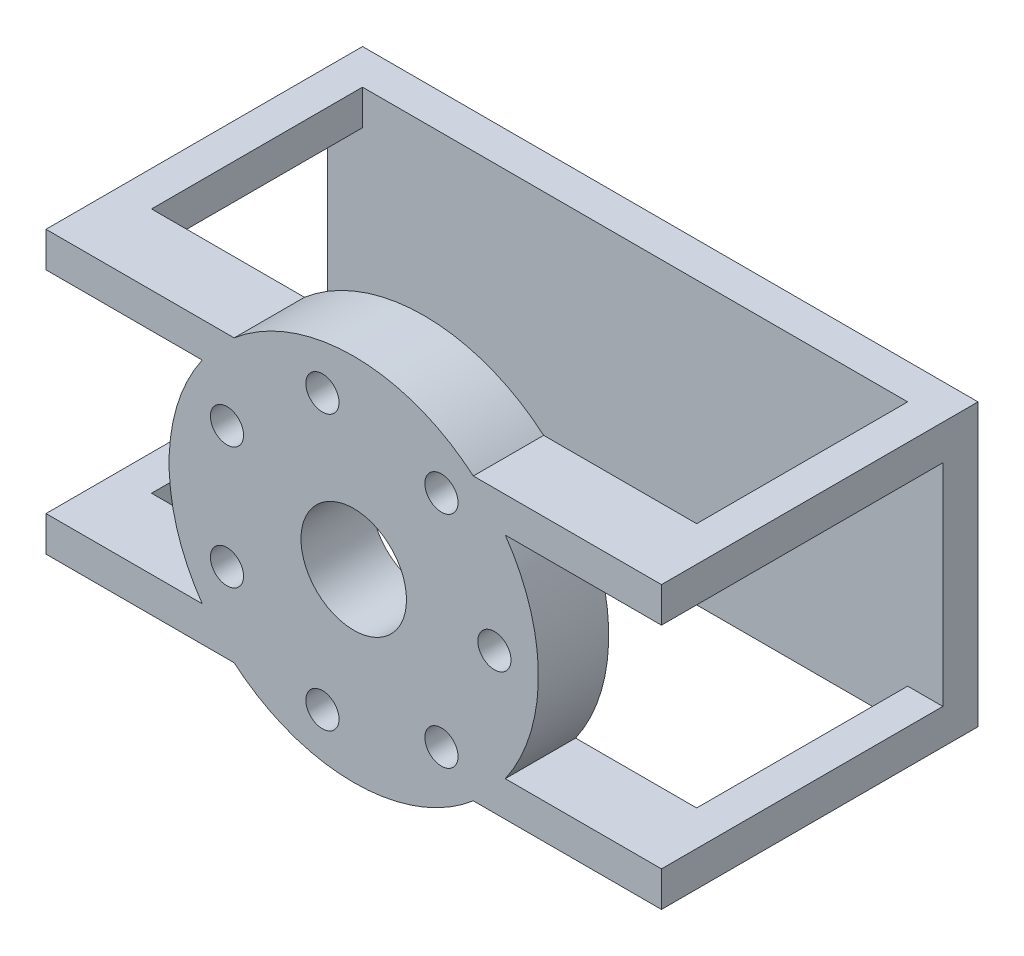
ISO-10303-21;
HEADER;
FILE_DESCRIPTION(('STEP AP214'),'2;1');
FILE_NAME('part.step','',(''),(''),'','','');
FILE_SCHEMA(('AUTOMOTIVE_DESIGN { 1 0 10303 214 1 1 1 1 }'));
ENDSEC;
DATA;
#1=APPLICATION_CONTEXT('core data for automotive mechanical design processes');
#2=APPLICATION_PROTOCOL_DEFINITION('international standard','automotive_design',2000,#1);
#3=PRODUCT_CONTEXT('',#1,'mechanical');
#4=PRODUCT('Part','Part','',(#3));
#5=PRODUCT_RELATED_PRODUCT_CATEGORY('part','',(#4));
#6=PRODUCT_DEFINITION_FORMATION('','',#4);
#7=PRODUCT_DEFINITION_CONTEXT('part definition',#1,'design');
#8=PRODUCT_DEFINITION('design','',#6,#7);
#9=PRODUCT_DEFINITION_SHAPE('','',#8);
#10=(LENGTH_UNIT() NAMED_UNIT(*) SI_UNIT(.MILLI.,.METRE.));
#11=(NAMED_UNIT(*) PLANE_ANGLE_UNIT() SI_UNIT($,.RADIAN.));
#12=(NAMED_UNIT(*) SI_UNIT($,.STERADIAN.) SOLID_ANGLE_UNIT());
#13=UNCERTAINTY_MEASURE_WITH_UNIT(LENGTH_MEASURE(1.E-05),#10,'distance_accuracy_value','');
#14=(GEOMETRIC_REPRESENTATION_CONTEXT(3) GLOBAL_UNCERTAINTY_ASSIGNED_CONTEXT((#13)) GLOBAL_UNIT_ASSIGNED_CONTEXT((#10,
#11,#12)) REPRESENTATION_CONTEXT('',''));
#15=CARTESIAN_POINT('',(0.,0.,0.));
#16=DIRECTION('',(0.,0.,1.));
#17=DIRECTION('',(1.,0.,0.));
#18=AXIS2_PLACEMENT_3D('',#15,#16,#17);
#19=CARTESIAN_POINT('',(-77.5,0.,-35.));
#20=DIRECTION('',(-1.,0.,0.));
#21=DIRECTION('',(0.,0.,1.));
#22=AXIS2_PLACEMENT_3D('',#19,#20,#21);
#23=PLANE('',#22);
#24=DIRECTION('',(0.,1.,0.));
#25=VECTOR('',#24,1.);
#26=CARTESIAN_POINT('',(-77.5,0.,25.));
#27=LINE('',#26,#25);
#28=CARTESIAN_POINT('',(-77.5,70.,25.));
#29=VERTEX_POINT('',#28);
#30=CARTESIAN_POINT('',(-77.5,80.,25.));
#31=VERTEX_POINT('',#30);
#32=EDGE_CURVE('E322',#29,#31,#27,.T.);
#33=ORIENTED_EDGE('',*,*,#32,.F.);
#34=DIRECTION('',(0.,0.,-1.));
#35=VECTOR('',#34,1.);
#36=CARTESIAN_POINT('',(-77.5,70.,-35.));
#37=LINE('',#36,#35);
#38=CARTESIAN_POINT('',(-77.5,70.,-35.));
#39=VERTEX_POINT('',#38);
#40=EDGE_CURVE('E215',#29,#39,#37,.T.);
#41=ORIENTED_EDGE('',*,*,#40,.T.);
#42=DIRECTION('',(0.,1.,0.));
#43=VECTOR('',#42,1.);
#44=CARTESIAN_POINT('',(-77.5,0.,-35.));
#45=LINE('',#44,#43);
#46=CARTESIAN_POINT('',(-77.5,80.,-35.));
#47=VERTEX_POINT('',#46);
#48=EDGE_CURVE('E338',#39,#47,#45,.T.);
#49=ORIENTED_EDGE('',*,*,#48,.T.);
#50=DIRECTION('',(0.,0.,1.));
#51=VECTOR('',#50,1.);
#52=CARTESIAN_POINT('',(-77.5,80.,-35.));
#53=LINE('',#52,#51);
#54=EDGE_CURVE('E307',#47,#31,#53,.T.);
#55=ORIENTED_EDGE('',*,*,#54,.T.);
#56=EDGE_LOOP('',(#33,#41,#49,#55));
#57=FACE_BOUND('',#56,.T.);
#58=ADVANCED_FACE('F35',(#57),#23,.F.);
#59=CARTESIAN_POINT('',(77.5,0.,-35.));
#60=DIRECTION('',(1.,0.,0.));
#61=DIRECTION('',(0.,0.,-1.));
#62=AXIS2_PLACEMENT_3D('',#59,#60,#61);
#63=PLANE('',#62);
#64=DIRECTION('',(0.,1.,0.));
#65=VECTOR('',#64,1.);
#66=CARTESIAN_POINT('',(77.5,0.,-35.));
#67=LINE('',#66,#65);
#68=CARTESIAN_POINT('',(77.5,70.,-35.));
#69=VERTEX_POINT('',#68);
#70=CARTESIAN_POINT('',(77.5,80.,-35.));
#71=VERTEX_POINT('',#70);
#72=EDGE_CURVE('E342',#69,#71,#67,.T.);
#73=ORIENTED_EDGE('',*,*,#72,.F.);
#74=DIRECTION('',(0.,0.,1.));
#75=VECTOR('',#74,1.);
#76=CARTESIAN_POINT('',(77.5,70.,-35.));
#77=LINE('',#76,#75);
#78=CARTESIAN_POINT('',(77.5,70.,25.));
#79=VERTEX_POINT('',#78);
#80=EDGE_CURVE('E303',#69,#79,#77,.T.);
#81=ORIENTED_EDGE('',*,*,#80,.T.);
#82=DIRECTION('',(0.,1.,0.));
#83=VECTOR('',#82,1.);
#84=CARTESIAN_POINT('',(77.5,0.,25.));
#85=LINE('',#84,#83);
#86=CARTESIAN_POINT('',(77.5,80.,25.));
#87=VERTEX_POINT('',#86);
#88=EDGE_CURVE('E346',#79,#87,#85,.T.);
#89=ORIENTED_EDGE('',*,*,#88,.T.);
#90=DIRECTION('',(0.,0.,-1.));
#91=VECTOR('',#90,1.);
#92=CARTESIAN_POINT('',(77.5,80.,-35.));
#93=LINE('',#92,#91);
#94=EDGE_CURVE('E329',#87,#71,#93,.T.);
#95=ORIENTED_EDGE('',*,*,#94,.T.);
#96=EDGE_LOOP('',(#73,#81,#89,#95));
#97=FACE_BOUND('',#96,.T.);
#98=ADVANCED_FACE('F417',(#97),#63,.F.);
#99=CARTESIAN_POINT('',(87.5,80.,-45.));
#100=DIRECTION('',(-1.,0.,0.));
#101=DIRECTION('',(0.,0.,1.));
#102=AXIS2_PLACEMENT_3D('',#99,#100,#101);
#103=PLANE('',#102);
#104=DIRECTION('',(0.,0.,-1.));
#105=VECTOR('',#104,1.);
#106=CARTESIAN_POINT('',(87.5,10.,25.));
#107=LINE('',#106,#105);
#108=CARTESIAN_POINT('',(87.5,9.99999999999998,45.));
#109=VERTEX_POINT('',#108);
#110=CARTESIAN_POINT('',(87.5,10.,-35.));
#111=VERTEX_POINT('',#110);
#112=EDGE_CURVE('E274',#109,#111,#107,.T.);
#113=ORIENTED_EDGE('',*,*,#112,.F.);
#114=DIRECTION('',(0.,-1.,0.));
#115=VECTOR('',#114,1.);
#116=CARTESIAN_POINT('',(87.5,80.,45.));
#117=LINE('',#116,#115);
#118=CARTESIAN_POINT('',(87.5,0.,45.));
#119=VERTEX_POINT('',#118);
#120=EDGE_CURVE('E359',#109,#119,#117,.T.);
#121=ORIENTED_EDGE('',*,*,#120,.T.);
#122=DIRECTION('',(0.,0.,-1.));
#123=VECTOR('',#122,1.);
#124=CARTESIAN_POINT('',(87.5,0.,-45.));
#125=LINE('',#124,#123);
#126=CARTESIAN_POINT('',(87.5,0.,-45.));
#127=VERTEX_POINT('',#126);
#128=EDGE_CURVE('E337',#119,#127,#125,.T.);
#129=ORIENTED_EDGE('',*,*,#128,.T.);
#130=DIRECTION('',(0.,-1.,0.));
#131=VECTOR('',#130,1.);
#132=CARTESIAN_POINT('',(87.5,80.,-45.));
#133=LINE('',#132,#131);
#134=CARTESIAN_POINT('',(87.5,80.,-45.));
#135=VERTEX_POINT('',#134);
#136=EDGE_CURVE('E11',#135,#127,#133,.T.);
#137=ORIENTED_EDGE('',*,*,#136,.F.);
#138=DIRECTION('',(0.,0.,-1.));
#139=VECTOR('',#138,1.);
#140=CARTESIAN_POINT('',(87.5,80.,-45.));
#141=LINE('',#140,#139);
#142=CARTESIAN_POINT('',(87.5,80.,45.));
#143=VERTEX_POINT('',#142);
#144=EDGE_CURVE('E349',#143,#135,#141,.T.);
#145=ORIENTED_EDGE('',*,*,#144,.F.);
#146=CARTESIAN_POINT('',(87.5,70.,45.));
#147=VERTEX_POINT('',#146);
#148=EDGE_CURVE('E369',#143,#147,#117,.T.);
#149=ORIENTED_EDGE('',*,*,#148,.T.);
#150=DIRECTION('',(0.,0.,1.));
#151=VECTOR('',#150,1.);
#152=CARTESIAN_POINT('',(87.5,70.,25.));
#153=LINE('',#152,#151);
#154=CARTESIAN_POINT('',(87.5,70.,-35.));
#155=VERTEX_POINT('',#154);
#156=EDGE_CURVE('E279',#155,#147,#153,.T.);
#157=ORIENTED_EDGE('',*,*,#156,.F.);
#158=DIRECTION('',(0.,1.,0.));
#159=VECTOR('',#158,1.);
#160=CARTESIAN_POINT('',(87.5,70.,-35.));
#161=LINE('',#160,#159);
#162=EDGE_CURVE('E287',#111,#155,#161,.T.);
#163=ORIENTED_EDGE('',*,*,#162,.F.);
#164=EDGE_LOOP('',(#113,#121,#129,#137,#145,#149,#157,#163));
#165=FACE_BOUND('',#164,.T.);
#166=ADVANCED_FACE('F37',(#165),#103,.F.);
#167=CARTESIAN_POINT('',(-87.5,80.,-45.));
#168=DIRECTION('',(0.,0.,1.));
#169=DIRECTION('',(1.,0.,0.));
#170=AXIS2_PLACEMENT_3D('',#167,#168,#169);
#171=PLANE('',#170);
#172=DIRECTION('',(-1.,0.,0.));
#173=VECTOR('',#172,1.);
#174=CARTESIAN_POINT('',(-87.5,0.,-45.));
#175=LINE('',#174,#173);
#176=CARTESIAN_POINT('',(-87.5,0.,-45.));
#177=VERTEX_POINT('',#176);
#178=EDGE_CURVE('E362',#127,#177,#175,.T.);
#179=ORIENTED_EDGE('',*,*,#178,.T.);
#180=DIRECTION('',(0.,-1.,0.));
#181=VECTOR('',#180,1.);
#182=CARTESIAN_POINT('',(-87.5,80.,-45.));
#183=LINE('',#182,#181);
#184=CARTESIAN_POINT('',(-87.5,80.,-45.));
#185=VERTEX_POINT('',#184);
#186=EDGE_CURVE('E43',#185,#177,#183,.T.);
#187=ORIENTED_EDGE('',*,*,#186,.F.);
#188=DIRECTION('',(-1.,0.,0.));
#189=VECTOR('',#188,1.);
#190=CARTESIAN_POINT('',(-87.5,80.,-45.));
#191=LINE('',#190,#189);
#192=EDGE_CURVE('E352',#135,#185,#191,.T.);
#193=ORIENTED_EDGE('',*,*,#192,.F.);
#194=ORIENTED_EDGE('',*,*,#136,.T.);
#195=EDGE_LOOP('',(#179,#187,#193,#194));
#196=FACE_BOUND('',#195,.T.);
#197=ADVANCED_FACE('F479',(#196),#171,.F.);
#198=CARTESIAN_POINT('',(-87.5,80.,-45.));
#199=DIRECTION('',(1.,0.,0.));
#200=DIRECTION('',(0.,0.,-1.));
#201=AXIS2_PLACEMENT_3D('',#198,#199,#200);
#202=PLANE('',#201);
#203=DIRECTION('',(0.,-1.,0.));
#204=VECTOR('',#203,1.);
#205=CARTESIAN_POINT('',(-87.4999999999999,80.,45.));
#206=LINE('',#205,#204);
#207=CARTESIAN_POINT('',(-87.4999999999999,9.99999999999999,45.));
#208=VERTEX_POINT('',#207);
#209=CARTESIAN_POINT('',(-87.4999999999999,0.,45.));
#210=VERTEX_POINT('',#209);
#211=EDGE_CURVE('E372',#208,#210,#206,.T.);
#212=ORIENTED_EDGE('',*,*,#211,.F.);
#213=DIRECTION('',(0.,0.,-1.));
#214=VECTOR('',#213,1.);
#215=CARTESIAN_POINT('',(-87.5,10.,24.9999999999999));
#216=LINE('',#215,#214);
#217=CARTESIAN_POINT('',(-87.5,9.99999999999999,-35.));
#218=VERTEX_POINT('',#217);
#219=EDGE_CURVE('E275',#208,#218,#216,.T.);
#220=ORIENTED_EDGE('',*,*,#219,.T.);
#221=DIRECTION('',(0.,1.,0.));
#222=VECTOR('',#221,1.);
#223=CARTESIAN_POINT('',(-87.5,70.,-35.));
#224=LINE('',#223,#222);
#225=CARTESIAN_POINT('',(-87.5,70.,-35.));
#226=VERTEX_POINT('',#225);
#227=EDGE_CURVE('E278',#218,#226,#224,.T.);
#228=ORIENTED_EDGE('',*,*,#227,.T.);
#229=DIRECTION('',(0.,0.,1.));
#230=VECTOR('',#229,1.);
#231=CARTESIAN_POINT('',(-87.5,70.,25.));
#232=LINE('',#231,#230);
#233=CARTESIAN_POINT('',(-87.4999999999999,70.,45.));
#234=VERTEX_POINT('',#233);
#235=EDGE_CURVE('E282',#226,#234,#232,.T.);
#236=ORIENTED_EDGE('',*,*,#235,.T.);
#237=CARTESIAN_POINT('',(-87.4999999999999,80.,45.));
#238=VERTEX_POINT('',#237);
#239=EDGE_CURVE('E373',#238,#234,#206,.T.);
#240=ORIENTED_EDGE('',*,*,#239,.F.);
#241=DIRECTION('',(0.,0.,1.));
#242=VECTOR('',#241,1.);
#243=CARTESIAN_POINT('',(-87.5,80.,-45.));
#244=LINE('',#243,#242);
#245=EDGE_CURVE('E355',#185,#238,#244,.T.);
#246=ORIENTED_EDGE('',*,*,#245,.F.);
#247=ORIENTED_EDGE('',*,*,#186,.T.);
#248=DIRECTION('',(0.,0.,1.));
#249=VECTOR('',#248,1.);
#250=CARTESIAN_POINT('',(-87.5,0.,-45.));
#251=LINE('',#250,#249);
#252=EDGE_CURVE('E364',#177,#210,#251,.T.);
#253=ORIENTED_EDGE('',*,*,#252,.T.);
#254=EDGE_LOOP('',(#212,#220,#228,#236,#240,#246,#247,#253));
#255=FACE_BOUND('',#254,.T.);
#256=ADVANCED_FACE('F381',(#255),#202,.F.);
#257=CARTESIAN_POINT('',(-87.4999999999999,80.,45.));
#258=DIRECTION('',(0.,0.,-1.));
#259=DIRECTION('',(-1.,0.,0.));
#260=AXIS2_PLACEMENT_3D('',#257,#258,#259);
#261=PLANE('',#260);
#262=CARTESIAN_POINT('',(0.,40.,45.));
#263=DIRECTION('',(0.,0.,1.));
#264=DIRECTION('',(1.,0.,0.));
#265=AXIS2_PLACEMENT_3D('',#262,#263,#264);
#266=CIRCLE('',#265,15.);
#267=CARTESIAN_POINT('',(15.,40.,45.));
#268=VERTEX_POINT('',#267);
#269=EDGE_CURVE('E751',#268,#268,#266,.T.);
#270=ORIENTED_EDGE('',*,*,#269,.F.);
#271=EDGE_LOOP('',(#270));
#272=FACE_BOUND('',#271,.T.);
#273=CARTESIAN_POINT('',(-8.90083735825273,78.9971164872729,45.));
#274=DIRECTION('',(0.,0.,1.));
#275=DIRECTION('',(-0.222520933956318,0.974927912181823,0.));
#276=AXIS2_PLACEMENT_3D('',#273,#274,#275);
#277=CIRCLE('',#276,4.71520780479736);
#278=CARTESIAN_POINT('',(-9.95006980277436,83.5941041879074,45.));
#279=VERTEX_POINT('',#278);
#280=EDGE_CURVE('E746',#279,#279,#277,.T.);
#281=ORIENTED_EDGE('',*,*,#280,.F.);
#282=EDGE_LOOP('',(#281));
#283=FACE_BOUND('',#282,.T.);
#284=CARTESIAN_POINT('',(-36.0387547160969,57.3553495647021,45.));
#285=DIRECTION('',(0.,0.,1.));
#286=DIRECTION('',(-0.900968867902422,0.433883739117553,0.));
#287=AXIS2_PLACEMENT_3D('',#284,#285,#286);
#288=CIRCLE('',#287,4.71520780479736);
#289=CARTESIAN_POINT('',(-40.2870101539098,59.4012015577638,45.));
#290=VERTEX_POINT('',#289);
#291=EDGE_CURVE('E740',#290,#290,#288,.T.);
#292=ORIENTED_EDGE('',*,*,#291,.F.);
#293=EDGE_LOOP('',(#292));
#294=FACE_BOUND('',#293,.T.);
#295=CARTESIAN_POINT('',(-36.0387547160966,22.6446504352974,45.));
#296=DIRECTION('',(0.,0.,1.));
#297=DIRECTION('',(-0.900968867902416,-0.433883739117565,0.));
#298=AXIS2_PLACEMENT_3D('',#295,#296,#297);
#299=CIRCLE('',#298,4.71520780479736);
#300=CARTESIAN_POINT('',(-40.2870101539095,20.5987984422356,45.));
#301=VERTEX_POINT('',#300);
#302=EDGE_CURVE('E734',#301,#301,#299,.T.);
#303=ORIENTED_EDGE('',*,*,#302,.F.);
#304=EDGE_LOOP('',(#303));
#305=FACE_BOUND('',#304,.T.);
#306=CARTESIAN_POINT('',(-8.9008373582522,1.00288351272697,45.));
#307=DIRECTION('',(0.,0.,1.));
#308=DIRECTION('',(-0.222520933956305,-0.974927912181826,0.));
#309=AXIS2_PLACEMENT_3D('',#306,#307,#308);
#310=CIRCLE('',#309,4.71520780479736);
#311=CARTESIAN_POINT('',(-9.95006980277377,-3.59410418790757,45.));
#312=VERTEX_POINT('',#311);
#313=EDGE_CURVE('E728',#312,#312,#310,.T.);
#314=ORIENTED_EDGE('',*,*,#313,.F.);
#315=EDGE_LOOP('',(#314));
#316=FACE_BOUND('',#315,.T.);
#317=CARTESIAN_POINT('',(24.9395920743497,8.72674070127911,45.));
#318=DIRECTION('',(0.,0.,1.));
#319=DIRECTION('',(0.623489801858743,-0.781831482468022,0.));
#320=AXIS2_PLACEMENT_3D('',#317,#318,#319);
#321=CIRCLE('',#320,4.71520780479736);
#322=CARTESIAN_POINT('',(27.8794760542856,5.04024279310961,45.));
#323=VERTEX_POINT('',#322);
#324=EDGE_CURVE('E721',#323,#323,#321,.T.);
#325=ORIENTED_EDGE('',*,*,#324,.F.);
#326=EDGE_LOOP('',(#325));
#327=FACE_BOUND('',#326,.T.);
#328=CARTESIAN_POINT('',(24.9395920743493,71.2732592987212,45.));
#329=DIRECTION('',(0.,0.,1.));
#330=DIRECTION('',(0.623489801858732,0.781831482468031,0.));
#331=AXIS2_PLACEMENT_3D('',#328,#329,#330);
#332=CIRCLE('',#331,4.71520780479736);
#333=CARTESIAN_POINT('',(27.8794760542851,74.9597572068908,45.));
#334=VERTEX_POINT('',#333);
#335=EDGE_CURVE('E713',#334,#334,#332,.T.);
#336=ORIENTED_EDGE('',*,*,#335,.F.);
#337=EDGE_LOOP('',(#336));
#338=FACE_BOUND('',#337,.T.);
#339=CARTESIAN_POINT('',(40.,40.,45.));
#340=DIRECTION('',(0.,0.,1.));
#341=DIRECTION('',(1.,0.,0.));
#342=AXIS2_PLACEMENT_3D('',#339,#340,#341);
#343=CIRCLE('',#342,4.71520780479736);
#344=CARTESIAN_POINT('',(44.7152078047974,40.,45.));
#345=VERTEX_POINT('',#344);
#346=EDGE_CURVE('E227',#345,#345,#343,.T.);
#347=ORIENTED_EDGE('',*,*,#346,.F.);
#348=EDGE_LOOP('',(#347));
#349=FACE_BOUND('',#348,.T.);
#350=CARTESIAN_POINT('',(0.,40.,45.));
#351=DIRECTION('',(0.,0.,-1.));
#352=DIRECTION('',(1.,0.,0.));
#353=AXIS2_PLACEMENT_3D('',#350,#351,#352);
#354=CIRCLE('',#353,52.5);
#355=CARTESIAN_POINT('',(-43.0842198490352,10.,45.));
#356=VERTEX_POINT('',#355);
#357=CARTESIAN_POINT('',(-43.0842198490352,70.,45.));
#358=VERTEX_POINT('',#357);
#359=EDGE_CURVE('E204',#356,#358,#354,.T.);
#360=ORIENTED_EDGE('',*,*,#359,.F.);
#361=DIRECTION('',(1.,0.,0.));
#362=VECTOR('',#361,1.);
#363=CARTESIAN_POINT('',(-43.0842198490352,10.,45.));
#364=LINE('',#363,#362);
#365=EDGE_CURVE('E221',#208,#356,#364,.T.);
#366=ORIENTED_EDGE('',*,*,#365,.F.);
#367=ORIENTED_EDGE('',*,*,#211,.T.);
#368=DIRECTION('',(1.,0.,0.));
#369=VECTOR('',#368,1.);
#370=CARTESIAN_POINT('',(-87.4999999999999,0.,45.));
#371=LINE('',#370,#369);
#372=CARTESIAN_POINT('',(-34.0036762718386,0.,45.));
#373=VERTEX_POINT('',#372);
#374=EDGE_CURVE('E353',#210,#373,#371,.T.);
#375=ORIENTED_EDGE('',*,*,#374,.T.);
#376=CARTESIAN_POINT('',(0.,40.,45.));
#377=DIRECTION('',(0.,0.,1.));
#378=DIRECTION('',(1.,0.,0.));
#379=AXIS2_PLACEMENT_3D('',#376,#377,#378);
#380=CIRCLE('',#379,52.5);
#381=CARTESIAN_POINT('',(34.0036762718386,0.,45.));
#382=VERTEX_POINT('',#381);
#383=EDGE_CURVE('E58',#373,#382,#380,.T.);
#384=ORIENTED_EDGE('',*,*,#383,.T.);
#385=EDGE_CURVE('E367',#382,#119,#371,.T.);
#386=ORIENTED_EDGE('',*,*,#385,.T.);
#387=ORIENTED_EDGE('',*,*,#120,.F.);
#388=DIRECTION('',(1.,0.,0.));
#389=VECTOR('',#388,1.);
#390=CARTESIAN_POINT('',(43.0842198490352,9.99999999999998,45.));
#391=LINE('',#390,#389);
#392=CARTESIAN_POINT('',(43.0842198490352,9.99999999999995,45.));
#393=VERTEX_POINT('',#392);
#394=EDGE_CURVE('E240',#393,#109,#391,.T.);
#395=ORIENTED_EDGE('',*,*,#394,.F.);
#396=CARTESIAN_POINT('',(0.,40.,45.));
#397=DIRECTION('',(0.,0.,-1.));
#398=DIRECTION('',(1.,0.,0.));
#399=AXIS2_PLACEMENT_3D('',#396,#397,#398);
#400=CIRCLE('',#399,52.5);
#401=CARTESIAN_POINT('',(43.0842198490352,70.,45.));
#402=VERTEX_POINT('',#401);
#403=EDGE_CURVE('E248',#402,#393,#400,.T.);
#404=ORIENTED_EDGE('',*,*,#403,.F.);
#405=DIRECTION('',(-1.,0.,0.));
#406=VECTOR('',#405,1.);
#407=CARTESIAN_POINT('',(87.5,70.,45.));
#408=LINE('',#407,#406);
#409=EDGE_CURVE('E234',#147,#402,#408,.T.);
#410=ORIENTED_EDGE('',*,*,#409,.F.);
#411=ORIENTED_EDGE('',*,*,#148,.F.);
#412=DIRECTION('',(1.,0.,0.));
#413=VECTOR('',#412,1.);
#414=CARTESIAN_POINT('',(-87.4999999999999,80.,45.));
#415=LINE('',#414,#413);
#416=CARTESIAN_POINT('',(34.0036762718386,80.,45.));
#417=VERTEX_POINT('',#416);
#418=EDGE_CURVE('E357',#417,#143,#415,.T.);
#419=ORIENTED_EDGE('',*,*,#418,.F.);
#420=CARTESIAN_POINT('',(-34.0036762718386,80.,45.));
#421=VERTEX_POINT('',#420);
#422=EDGE_CURVE('E261',#417,#421,#380,.T.);
#423=ORIENTED_EDGE('',*,*,#422,.T.);
#424=EDGE_CURVE('E50',#238,#421,#415,.T.);
#425=ORIENTED_EDGE('',*,*,#424,.F.);
#426=ORIENTED_EDGE('',*,*,#239,.T.);
#427=DIRECTION('',(-1.,0.,0.));
#428=VECTOR('',#427,1.);
#429=CARTESIAN_POINT('',(-43.0842198490352,70.,45.));
#430=LINE('',#429,#428);
#431=EDGE_CURVE('E224',#358,#234,#430,.T.);
#432=ORIENTED_EDGE('',*,*,#431,.F.);
#433=EDGE_LOOP('',(#360,#366,#367,#375,#384,#386,#387,#395,#404,#410,#411,#419,#423,#425,#426,#432));
#434=FACE_BOUND('',#433,.T.);
#435=ADVANCED_FACE('F388',(#272,#283,#294,#305,#316,#327,#338,#349,#434),#261,.F.);
#436=CARTESIAN_POINT('',(0.,80.,0.));
#437=DIRECTION('',(0.,1.,0.));
#438=DIRECTION('',(0.,0.,1.));
#439=AXIS2_PLACEMENT_3D('',#436,#437,#438);
#440=PLANE('',#439);
#441=DIRECTION('',(0.,0.,1.));
#442=VECTOR('',#441,1.);
#443=CARTESIAN_POINT('',(-34.0036762718386,80.,25.));
#444=LINE('',#443,#442);
#445=CARTESIAN_POINT('',(-34.0036762718386,80.,25.));
#446=VERTEX_POINT('',#445);
#447=EDGE_CURVE('E272',#446,#421,#444,.T.);
#448=ORIENTED_EDGE('',*,*,#447,.F.);
#449=DIRECTION('',(1.,0.,0.));
#450=VECTOR('',#449,1.);
#451=CARTESIAN_POINT('',(-77.5,80.,25.));
#452=LINE('',#451,#450);
#453=EDGE_CURVE('E326',#31,#446,#452,.T.);
#454=ORIENTED_EDGE('',*,*,#453,.F.);
#455=ORIENTED_EDGE('',*,*,#54,.F.);
#456=DIRECTION('',(-1.,0.,0.));
#457=VECTOR('',#456,1.);
#458=CARTESIAN_POINT('',(-77.5,80.,-35.));
#459=LINE('',#458,#457);
#460=EDGE_CURVE('E312',#71,#47,#459,.T.);
#461=ORIENTED_EDGE('',*,*,#460,.F.);
#462=ORIENTED_EDGE('',*,*,#94,.F.);
#463=CARTESIAN_POINT('',(34.0036762718386,80.,25.));
#464=VERTEX_POINT('',#463);
#465=EDGE_CURVE('E325',#464,#87,#452,.T.);
#466=ORIENTED_EDGE('',*,*,#465,.F.);
#467=DIRECTION('',(0.,0.,1.));
#468=VECTOR('',#467,1.);
#469=CARTESIAN_POINT('',(34.0036762718386,80.,25.));
#470=LINE('',#469,#468);
#471=EDGE_CURVE('E269',#417,#464,#470,.F.);
#472=ORIENTED_EDGE('',*,*,#471,.F.);
#473=ORIENTED_EDGE('',*,*,#418,.T.);
#474=ORIENTED_EDGE('',*,*,#144,.T.);
#475=ORIENTED_EDGE('',*,*,#192,.T.);
#476=ORIENTED_EDGE('',*,*,#245,.T.);
#477=ORIENTED_EDGE('',*,*,#424,.T.);
#478=EDGE_LOOP('',(#448,#454,#455,#461,#462,#466,#472,#473,#474,#475,#476,#477));
#479=FACE_BOUND('',#478,.T.);
#480=ADVANCED_FACE('F423',(#479),#440,.T.);
#481=CARTESIAN_POINT('',(0.,0.,0.));
#482=DIRECTION('',(0.,1.,0.));
#483=DIRECTION('',(0.,0.,1.));
#484=AXIS2_PLACEMENT_3D('',#481,#482,#483);
#485=PLANE('',#484);
#486=DIRECTION('',(1.,0.,0.));
#487=VECTOR('',#486,1.);
#488=CARTESIAN_POINT('',(-77.5,0.,25.));
#489=LINE('',#488,#487);
#490=CARTESIAN_POINT('',(-77.5,0.,25.));
#491=VERTEX_POINT('',#490);
#492=CARTESIAN_POINT('',(-34.0036762718386,0.,25.));
#493=VERTEX_POINT('',#492);
#494=EDGE_CURVE('E313',#491,#493,#489,.T.);
#495=ORIENTED_EDGE('',*,*,#494,.T.);
#496=DIRECTION('',(0.,0.,1.));
#497=VECTOR('',#496,1.);
#498=CARTESIAN_POINT('',(-34.0036762718386,0.,25.));
#499=LINE('',#498,#497);
#500=EDGE_CURVE('E266',#493,#373,#499,.T.);
#501=ORIENTED_EDGE('',*,*,#500,.T.);
#502=ORIENTED_EDGE('',*,*,#374,.F.);
#503=ORIENTED_EDGE('',*,*,#252,.F.);
#504=ORIENTED_EDGE('',*,*,#178,.F.);
#505=ORIENTED_EDGE('',*,*,#128,.F.);
#506=ORIENTED_EDGE('',*,*,#385,.F.);
#507=DIRECTION('',(0.,0.,1.));
#508=VECTOR('',#507,1.);
#509=CARTESIAN_POINT('',(34.0036762718386,0.,25.));
#510=LINE('',#509,#508);
#511=CARTESIAN_POINT('',(34.0036762718386,0.,25.));
#512=VERTEX_POINT('',#511);
#513=EDGE_CURVE('E259',#382,#512,#510,.F.);
#514=ORIENTED_EDGE('',*,*,#513,.T.);
#515=CARTESIAN_POINT('',(77.5,0.,25.));
#516=VERTEX_POINT('',#515);
#517=EDGE_CURVE('E311',#512,#516,#489,.T.);
#518=ORIENTED_EDGE('',*,*,#517,.T.);
#519=DIRECTION('',(0.,0.,-1.));
#520=VECTOR('',#519,1.);
#521=CARTESIAN_POINT('',(77.5,0.,-35.));
#522=LINE('',#521,#520);
#523=CARTESIAN_POINT('',(77.5,0.,-35.));
#524=VERTEX_POINT('',#523);
#525=EDGE_CURVE('E316',#516,#524,#522,.T.);
#526=ORIENTED_EDGE('',*,*,#525,.T.);
#527=DIRECTION('',(-1.,0.,0.));
#528=VECTOR('',#527,1.);
#529=CARTESIAN_POINT('',(-77.5,0.,-35.));
#530=LINE('',#529,#528);
#531=CARTESIAN_POINT('',(-77.5,0.,-35.));
#532=VERTEX_POINT('',#531);
#533=EDGE_CURVE('E319',#524,#532,#530,.T.);
#534=ORIENTED_EDGE('',*,*,#533,.T.);
#535=DIRECTION('',(0.,0.,1.));
#536=VECTOR('',#535,1.);
#537=CARTESIAN_POINT('',(-77.5,0.,-35.));
#538=LINE('',#537,#536);
#539=EDGE_CURVE('E308',#532,#491,#538,.T.);
#540=ORIENTED_EDGE('',*,*,#539,.T.);
#541=EDGE_LOOP('',(#495,#501,#502,#503,#504,#505,#506,#514,#518,#526,#534,#540));
#542=FACE_BOUND('',#541,.T.);
#543=ADVANCED_FACE('F386',(#542),#485,.F.);
#544=CARTESIAN_POINT('',(-77.5,10.,-35.));
#545=VERTEX_POINT('',#544);
#546=EDGE_CURVE('E334',#532,#545,#45,.T.);
#547=ORIENTED_EDGE('',*,*,#546,.T.);
#548=DIRECTION('',(0.,0.,1.));
#549=VECTOR('',#548,1.);
#550=CARTESIAN_POINT('',(-77.5,10.,-35.));
#551=LINE('',#550,#549);
#552=CARTESIAN_POINT('',(-77.5,10.,25.));
#553=VERTEX_POINT('',#552);
#554=EDGE_CURVE('E300',#545,#553,#551,.T.);
#555=ORIENTED_EDGE('',*,*,#554,.T.);
#556=EDGE_CURVE('E347',#491,#553,#27,.T.);
#557=ORIENTED_EDGE('',*,*,#556,.F.);
#558=ORIENTED_EDGE('',*,*,#539,.F.);
#559=EDGE_LOOP('',(#547,#555,#557,#558));
#560=FACE_BOUND('',#559,.T.);
#561=ADVANCED_FACE('F398',(#560),#23,.F.);
#562=CARTESIAN_POINT('',(-77.5,0.,-35.));
#563=DIRECTION('',(0.,0.,-1.));
#564=DIRECTION('',(-1.,0.,0.));
#565=AXIS2_PLACEMENT_3D('',#562,#563,#564);
#566=PLANE('',#565);
#567=CARTESIAN_POINT('',(77.5,10.,-35.));
#568=VERTEX_POINT('',#567);
#569=EDGE_CURVE('E339',#524,#568,#67,.T.);
#570=ORIENTED_EDGE('',*,*,#569,.T.);
#571=DIRECTION('',(1.,0.,0.));
#572=VECTOR('',#571,1.);
#573=CARTESIAN_POINT('',(-87.5,10.,-35.));
#574=LINE('',#573,#572);
#575=EDGE_CURVE('E284',#568,#111,#574,.T.);
#576=ORIENTED_EDGE('',*,*,#575,.T.);
#577=ORIENTED_EDGE('',*,*,#162,.T.);
#578=DIRECTION('',(1.,0.,0.));
#579=VECTOR('',#578,1.);
#580=CARTESIAN_POINT('',(-87.5,70.,-35.));
#581=LINE('',#580,#579);
#582=EDGE_CURVE('E294',#69,#155,#581,.T.);
#583=ORIENTED_EDGE('',*,*,#582,.F.);
#584=ORIENTED_EDGE('',*,*,#72,.T.);
#585=ORIENTED_EDGE('',*,*,#460,.T.);
#586=ORIENTED_EDGE('',*,*,#48,.F.);
#587=EDGE_CURVE('E291',#226,#39,#581,.T.);
#588=ORIENTED_EDGE('',*,*,#587,.F.);
#589=ORIENTED_EDGE('',*,*,#227,.F.);
#590=EDGE_CURVE('E295',#218,#545,#574,.T.);
#591=ORIENTED_EDGE('',*,*,#590,.T.);
#592=ORIENTED_EDGE('',*,*,#546,.F.);
#593=ORIENTED_EDGE('',*,*,#533,.F.);
#594=EDGE_LOOP('',(#570,#576,#577,#583,#584,#585,#586,#588,#589,#591,#592,#593));
#595=FACE_BOUND('',#594,.T.);
#596=ADVANCED_FACE('F394',(#595),#566,.F.);
#597=CARTESIAN_POINT('',(77.5,9.99999999999998,25.));
#598=VERTEX_POINT('',#597);
#599=EDGE_CURVE('E343',#516,#598,#85,.T.);
#600=ORIENTED_EDGE('',*,*,#599,.T.);
#601=DIRECTION('',(0.,0.,-1.));
#602=VECTOR('',#601,1.);
#603=CARTESIAN_POINT('',(77.5,10.,-35.));
#604=LINE('',#603,#602);
#605=EDGE_CURVE('E293',#598,#568,#604,.T.);
#606=ORIENTED_EDGE('',*,*,#605,.T.);
#607=ORIENTED_EDGE('',*,*,#569,.F.);
#608=ORIENTED_EDGE('',*,*,#525,.F.);
#609=EDGE_LOOP('',(#600,#606,#607,#608));
#610=FACE_BOUND('',#609,.T.);
#611=ADVANCED_FACE('F402',(#610),#63,.F.);
#612=CARTESIAN_POINT('',(-77.5,0.,25.));
#613=DIRECTION('',(0.,0.,1.));
#614=DIRECTION('',(1.,0.,0.));
#615=AXIS2_PLACEMENT_3D('',#612,#613,#614);
#616=PLANE('',#615);
#617=CARTESIAN_POINT('',(0.,40.,25.));
#618=DIRECTION('',(0.,0.,1.));
#619=DIRECTION('',(1.,0.,0.));
#620=AXIS2_PLACEMENT_3D('',#617,#618,#619);
#621=CIRCLE('',#620,15.);
#622=CARTESIAN_POINT('',(15.,40.,25.));
#623=VERTEX_POINT('',#622);
#624=EDGE_CURVE('E725',#623,#623,#621,.T.);
#625=ORIENTED_EDGE('',*,*,#624,.T.);
#626=EDGE_LOOP('',(#625));
#627=FACE_BOUND('',#626,.T.);
#628=CARTESIAN_POINT('',(-8.90083735825273,78.9971164872729,25.));
#629=DIRECTION('',(0.,0.,1.));
#630=DIRECTION('',(-0.222520933956318,0.974927912181823,0.));
#631=AXIS2_PLACEMENT_3D('',#628,#629,#630);
#632=CIRCLE('',#631,4.71520780479736);
#633=CARTESIAN_POINT('',(-9.95006980277436,83.5941041879074,25.));
#634=VERTEX_POINT('',#633);
#635=EDGE_CURVE('E718',#634,#634,#632,.T.);
#636=ORIENTED_EDGE('',*,*,#635,.T.);
#637=EDGE_LOOP('',(#636));
#638=FACE_BOUND('',#637,.T.);
#639=CARTESIAN_POINT('',(-36.0387547160969,57.3553495647021,25.));
#640=DIRECTION('',(0.,0.,1.));
#641=DIRECTION('',(-0.900968867902422,0.433883739117553,0.));
#642=AXIS2_PLACEMENT_3D('',#639,#640,#641);
#643=CIRCLE('',#642,4.71520780479736);
#644=CARTESIAN_POINT('',(-40.2870101539098,59.4012015577638,25.));
#645=VERTEX_POINT('',#644);
#646=EDGE_CURVE('E743',#645,#645,#643,.T.);
#647=ORIENTED_EDGE('',*,*,#646,.T.);
#648=EDGE_LOOP('',(#647));
#649=FACE_BOUND('',#648,.T.);
#650=CARTESIAN_POINT('',(-36.0387547160966,22.6446504352974,25.));
#651=DIRECTION('',(0.,0.,1.));
#652=DIRECTION('',(-0.900968867902416,-0.433883739117565,0.));
#653=AXIS2_PLACEMENT_3D('',#650,#651,#652);
#654=CIRCLE('',#653,4.71520780479736);
#655=CARTESIAN_POINT('',(-40.2870101539095,20.5987984422356,25.));
#656=VERTEX_POINT('',#655);
#657=EDGE_CURVE('E737',#656,#656,#654,.T.);
#658=ORIENTED_EDGE('',*,*,#657,.T.);
#659=EDGE_LOOP('',(#658));
#660=FACE_BOUND('',#659,.T.);
#661=CARTESIAN_POINT('',(-8.9008373582522,1.00288351272697,25.));
#662=DIRECTION('',(0.,0.,1.));
#663=DIRECTION('',(-0.222520933956305,-0.974927912181826,0.));
#664=AXIS2_PLACEMENT_3D('',#661,#662,#663);
#665=CIRCLE('',#664,4.71520780479736);
#666=CARTESIAN_POINT('',(-9.95006980277377,-3.59410418790757,25.));
#667=VERTEX_POINT('',#666);
#668=EDGE_CURVE('E731',#667,#667,#665,.T.);
#669=ORIENTED_EDGE('',*,*,#668,.T.);
#670=EDGE_LOOP('',(#669));
#671=FACE_BOUND('',#670,.T.);
#672=CARTESIAN_POINT('',(24.9395920743497,8.72674070127911,25.));
#673=DIRECTION('',(0.,0.,1.));
#674=DIRECTION('',(0.623489801858743,-0.781831482468022,0.));
#675=AXIS2_PLACEMENT_3D('',#672,#673,#674);
#676=CIRCLE('',#675,4.71520780479736);
#677=CARTESIAN_POINT('',(27.8794760542856,5.04024279310961,25.));
#678=VERTEX_POINT('',#677);
#679=EDGE_CURVE('E724',#678,#678,#676,.T.);
#680=ORIENTED_EDGE('',*,*,#679,.T.);
#681=EDGE_LOOP('',(#680));
#682=FACE_BOUND('',#681,.T.);
#683=CARTESIAN_POINT('',(24.9395920743493,71.2732592987212,25.));
#684=DIRECTION('',(0.,0.,1.));
#685=DIRECTION('',(0.623489801858732,0.781831482468031,0.));
#686=AXIS2_PLACEMENT_3D('',#683,#684,#685);
#687=CIRCLE('',#686,4.71520780479736);
#688=CARTESIAN_POINT('',(27.8794760542851,74.9597572068908,25.));
#689=VERTEX_POINT('',#688);
#690=EDGE_CURVE('E711',#689,#689,#687,.T.);
#691=ORIENTED_EDGE('',*,*,#690,.T.);
#692=EDGE_LOOP('',(#691));
#693=FACE_BOUND('',#692,.T.);
#694=CARTESIAN_POINT('',(40.,40.,25.));
#695=DIRECTION('',(0.,0.,1.));
#696=DIRECTION('',(1.,0.,0.));
#697=AXIS2_PLACEMENT_3D('',#694,#695,#696);
#698=CIRCLE('',#697,4.71520780479736);
#699=CARTESIAN_POINT('',(44.7152078047974,40.,25.));
#700=VERTEX_POINT('',#699);
#701=EDGE_CURVE('E232',#700,#700,#698,.T.);
#702=ORIENTED_EDGE('',*,*,#701,.T.);
#703=EDGE_LOOP('',(#702));
#704=FACE_BOUND('',#703,.T.);
#705=ORIENTED_EDGE('',*,*,#556,.T.);
#706=DIRECTION('',(1.,0.,0.));
#707=VECTOR('',#706,1.);
#708=CARTESIAN_POINT('',(-43.0842198490352,10.,25.));
#709=LINE('',#708,#707);
#710=CARTESIAN_POINT('',(-43.0842198490352,10.,25.));
#711=VERTEX_POINT('',#710);
#712=EDGE_CURVE('E209',#553,#711,#709,.T.);
#713=ORIENTED_EDGE('',*,*,#712,.T.);
#714=CARTESIAN_POINT('',(0.,40.,25.));
#715=DIRECTION('',(0.,0.,-1.));
#716=DIRECTION('',(1.,0.,0.));
#717=AXIS2_PLACEMENT_3D('',#714,#715,#716);
#718=CIRCLE('',#717,52.5);
#719=CARTESIAN_POINT('',(-43.0842198490352,70.,25.));
#720=VERTEX_POINT('',#719);
#721=EDGE_CURVE('E201',#711,#720,#718,.T.);
#722=ORIENTED_EDGE('',*,*,#721,.T.);
#723=DIRECTION('',(-1.,0.,0.));
#724=VECTOR('',#723,1.);
#725=CARTESIAN_POINT('',(-43.0842198490352,70.,25.));
#726=LINE('',#725,#724);
#727=EDGE_CURVE('E212',#720,#29,#726,.T.);
#728=ORIENTED_EDGE('',*,*,#727,.T.);
#729=ORIENTED_EDGE('',*,*,#32,.T.);
#730=ORIENTED_EDGE('',*,*,#453,.T.);
#731=CARTESIAN_POINT('',(0.,40.,25.));
#732=DIRECTION('',(0.,0.,1.));
#733=DIRECTION('',(1.,0.,0.));
#734=AXIS2_PLACEMENT_3D('',#731,#732,#733);
#735=CIRCLE('',#734,52.5);
#736=EDGE_CURVE('E256',#464,#446,#735,.T.);
#737=ORIENTED_EDGE('',*,*,#736,.F.);
#738=ORIENTED_EDGE('',*,*,#465,.T.);
#739=ORIENTED_EDGE('',*,*,#88,.F.);
#740=DIRECTION('',(-1.,0.,0.));
#741=VECTOR('',#740,1.);
#742=CARTESIAN_POINT('',(87.5,70.,25.));
#743=LINE('',#742,#741);
#744=CARTESIAN_POINT('',(43.0842198490352,70.,25.));
#745=VERTEX_POINT('',#744);
#746=EDGE_CURVE('E236',#79,#745,#743,.T.);
#747=ORIENTED_EDGE('',*,*,#746,.T.);
#748=CARTESIAN_POINT('',(0.,40.,25.));
#749=DIRECTION('',(0.,0.,-1.));
#750=DIRECTION('',(1.,0.,0.));
#751=AXIS2_PLACEMENT_3D('',#748,#749,#750);
#752=CIRCLE('',#751,52.5);
#753=CARTESIAN_POINT('',(43.0842198490352,9.99999999999995,25.));
#754=VERTEX_POINT('',#753);
#755=EDGE_CURVE('E239',#745,#754,#752,.T.);
#756=ORIENTED_EDGE('',*,*,#755,.T.);
#757=DIRECTION('',(1.,0.,0.));
#758=VECTOR('',#757,1.);
#759=CARTESIAN_POINT('',(43.0842198490352,9.99999999999998,25.));
#760=LINE('',#759,#758);
#761=EDGE_CURVE('E243',#754,#598,#760,.T.);
#762=ORIENTED_EDGE('',*,*,#761,.T.);
#763=ORIENTED_EDGE('',*,*,#599,.F.);
#764=ORIENTED_EDGE('',*,*,#517,.F.);
#765=EDGE_CURVE('E260',#493,#512,#735,.T.);
#766=ORIENTED_EDGE('',*,*,#765,.F.);
#767=ORIENTED_EDGE('',*,*,#494,.F.);
#768=EDGE_LOOP('',(#705,#713,#722,#728,#729,#730,#737,#738,#739,#747,#756,#762,#763,#764,#766,#767));
#769=FACE_BOUND('',#768,.T.);
#770=ADVANCED_FACE('F220',(#627,#638,#649,#660,#671,#682,#693,#704,#769),#616,.F.);
#771=CARTESIAN_POINT('',(-87.5,10.,24.9999999999999));
#772=DIRECTION('',(0.,-1.,0.));
#773=DIRECTION('',(0.,0.,-1.));
#774=AXIS2_PLACEMENT_3D('',#771,#772,#773);
#775=PLANE('',#774);
#776=ORIENTED_EDGE('',*,*,#605,.F.);
#777=ORIENTED_EDGE('',*,*,#761,.F.);
#778=DIRECTION('',(0.,0.,1.));
#779=VECTOR('',#778,1.);
#780=CARTESIAN_POINT('',(43.0842198490352,9.99999999999995,25.));
#781=LINE('',#780,#779);
#782=EDGE_CURVE('E253',#754,#393,#781,.T.);
#783=ORIENTED_EDGE('',*,*,#782,.T.);
#784=ORIENTED_EDGE('',*,*,#394,.T.);
#785=ORIENTED_EDGE('',*,*,#112,.T.);
#786=ORIENTED_EDGE('',*,*,#575,.F.);
#787=EDGE_LOOP('',(#776,#777,#783,#784,#785,#786));
#788=FACE_BOUND('',#787,.T.);
#789=ADVANCED_FACE('F407',(#788),#775,.F.);
#790=CARTESIAN_POINT('',(-87.5,70.,25.));
#791=DIRECTION('',(0.,1.,0.));
#792=DIRECTION('',(0.,0.,1.));
#793=AXIS2_PLACEMENT_3D('',#790,#791,#792);
#794=PLANE('',#793);
#795=ORIENTED_EDGE('',*,*,#582,.T.);
#796=ORIENTED_EDGE('',*,*,#156,.T.);
#797=ORIENTED_EDGE('',*,*,#409,.T.);
#798=DIRECTION('',(0.,0.,1.));
#799=VECTOR('',#798,1.);
#800=CARTESIAN_POINT('',(43.0842198490352,70.,25.));
#801=LINE('',#800,#799);
#802=EDGE_CURVE('E245',#745,#402,#801,.T.);
#803=ORIENTED_EDGE('',*,*,#802,.F.);
#804=ORIENTED_EDGE('',*,*,#746,.F.);
#805=ORIENTED_EDGE('',*,*,#80,.F.);
#806=EDGE_LOOP('',(#795,#796,#797,#803,#804,#805));
#807=FACE_BOUND('',#806,.T.);
#808=ADVANCED_FACE('F435',(#807),#794,.F.);
#809=ORIENTED_EDGE('',*,*,#40,.F.);
#810=ORIENTED_EDGE('',*,*,#727,.F.);
#811=DIRECTION('',(0.,0.,1.));
#812=VECTOR('',#811,1.);
#813=CARTESIAN_POINT('',(-43.0842198490352,70.,25.));
#814=LINE('',#813,#812);
#815=EDGE_CURVE('E197',#720,#358,#814,.T.);
#816=ORIENTED_EDGE('',*,*,#815,.T.);
#817=ORIENTED_EDGE('',*,*,#431,.T.);
#818=ORIENTED_EDGE('',*,*,#235,.F.);
#819=ORIENTED_EDGE('',*,*,#587,.T.);
#820=EDGE_LOOP('',(#809,#810,#816,#817,#818,#819));
#821=FACE_BOUND('',#820,.T.);
#822=ADVANCED_FACE('F213',(#821),#794,.F.);
#823=ORIENTED_EDGE('',*,*,#590,.F.);
#824=ORIENTED_EDGE('',*,*,#219,.F.);
#825=ORIENTED_EDGE('',*,*,#365,.T.);
#826=DIRECTION('',(0.,0.,1.));
#827=VECTOR('',#826,1.);
#828=CARTESIAN_POINT('',(-43.0842198490352,10.,25.));
#829=LINE('',#828,#827);
#830=EDGE_CURVE('E208',#711,#356,#829,.T.);
#831=ORIENTED_EDGE('',*,*,#830,.F.);
#832=ORIENTED_EDGE('',*,*,#712,.F.);
#833=ORIENTED_EDGE('',*,*,#554,.F.);
#834=EDGE_LOOP('',(#823,#824,#825,#831,#832,#833));
#835=FACE_BOUND('',#834,.T.);
#836=ADVANCED_FACE('F392',(#835),#775,.F.);
#837=CARTESIAN_POINT('',(0.,40.,25.));
#838=DIRECTION('',(0.,0.,1.));
#839=DIRECTION('',(1.,0.,0.));
#840=AXIS2_PLACEMENT_3D('',#837,#838,#839);
#841=CYLINDRICAL_SURFACE('',#840,52.5);
#842=ORIENTED_EDGE('',*,*,#500,.F.);
#843=ORIENTED_EDGE('',*,*,#765,.T.);
#844=ORIENTED_EDGE('',*,*,#513,.F.);
#845=ORIENTED_EDGE('',*,*,#383,.F.);
#846=EDGE_LOOP('',(#842,#843,#844,#845));
#847=FACE_BOUND('',#846,.T.);
#848=ADVANCED_FACE('F446',(#847),#841,.T.);
#849=ORIENTED_EDGE('',*,*,#736,.T.);
#850=ORIENTED_EDGE('',*,*,#447,.T.);
#851=ORIENTED_EDGE('',*,*,#422,.F.);
#852=ORIENTED_EDGE('',*,*,#471,.T.);
#853=EDGE_LOOP('',(#849,#850,#851,#852));
#854=FACE_BOUND('',#853,.T.);
#855=ADVANCED_FACE('F430',(#854),#841,.T.);
#856=CARTESIAN_POINT('',(0.,40.,25.));
#857=DIRECTION('',(0.,0.,1.));
#858=DIRECTION('',(1.,0.,0.));
#859=AXIS2_PLACEMENT_3D('',#856,#857,#858);
#860=CYLINDRICAL_SURFACE('',#859,52.5);
#861=ORIENTED_EDGE('',*,*,#403,.T.);
#862=ORIENTED_EDGE('',*,*,#782,.F.);
#863=ORIENTED_EDGE('',*,*,#755,.F.);
#864=ORIENTED_EDGE('',*,*,#802,.T.);
#865=EDGE_LOOP('',(#861,#862,#863,#864));
#866=FACE_BOUND('',#865,.T.);
#867=ADVANCED_FACE('F439',(#866),#860,.T.);
#868=CARTESIAN_POINT('',(0.,40.,25.));
#869=DIRECTION('',(0.,0.,1.));
#870=DIRECTION('',(1.,0.,0.));
#871=AXIS2_PLACEMENT_3D('',#868,#869,#870);
#872=CYLINDRICAL_SURFACE('',#871,52.5);
#873=ORIENTED_EDGE('',*,*,#359,.T.);
#874=ORIENTED_EDGE('',*,*,#815,.F.);
#875=ORIENTED_EDGE('',*,*,#721,.F.);
#876=ORIENTED_EDGE('',*,*,#830,.T.);
#877=EDGE_LOOP('',(#873,#874,#875,#876));
#878=FACE_BOUND('',#877,.T.);
#879=ADVANCED_FACE('F199',(#878),#872,.T.);
#880=CARTESIAN_POINT('',(40.,40.,25.));
#881=DIRECTION('',(0.,0.,1.));
#882=DIRECTION('',(1.,0.,0.));
#883=AXIS2_PLACEMENT_3D('',#880,#881,#882);
#884=CYLINDRICAL_SURFACE('',#883,4.71520780479736);
#885=ORIENTED_EDGE('',*,*,#701,.F.);
#886=EDGE_LOOP('',(#885));
#887=FACE_BOUND('',#886,.T.);
#888=ORIENTED_EDGE('',*,*,#346,.T.);
#889=EDGE_LOOP('',(#888));
#890=FACE_BOUND('',#889,.T.);
#891=ADVANCED_FACE('F622',(#887,#890),#884,.F.);
#892=CARTESIAN_POINT('',(24.9395920743493,71.2732592987212,25.));
#893=DIRECTION('',(0.,0.,1.));
#894=DIRECTION('',(1.,0.,0.));
#895=AXIS2_PLACEMENT_3D('',#892,#893,#894);
#896=CYLINDRICAL_SURFACE('',#895,4.71520780479736);
#897=ORIENTED_EDGE('',*,*,#690,.F.);
#898=EDGE_LOOP('',(#897));
#899=FACE_BOUND('',#898,.T.);
#900=ORIENTED_EDGE('',*,*,#335,.T.);
#901=EDGE_LOOP('',(#900));
#902=FACE_BOUND('',#901,.T.);
#903=ADVANCED_FACE('F614',(#899,#902),#896,.F.);
#904=CARTESIAN_POINT('',(24.9395920743497,8.72674070127911,25.));
#905=DIRECTION('',(0.,0.,1.));
#906=DIRECTION('',(1.,0.,0.));
#907=AXIS2_PLACEMENT_3D('',#904,#905,#906);
#908=CYLINDRICAL_SURFACE('',#907,4.71520780479736);
#909=ORIENTED_EDGE('',*,*,#679,.F.);
#910=EDGE_LOOP('',(#909));
#911=FACE_BOUND('',#910,.T.);
#912=ORIENTED_EDGE('',*,*,#324,.T.);
#913=EDGE_LOOP('',(#912));
#914=FACE_BOUND('',#913,.T.);
#915=ADVANCED_FACE('F606',(#911,#914),#908,.F.);
#916=CARTESIAN_POINT('',(-8.9008373582522,1.00288351272697,25.));
#917=DIRECTION('',(0.,0.,1.));
#918=DIRECTION('',(1.,0.,0.));
#919=AXIS2_PLACEMENT_3D('',#916,#917,#918);
#920=CYLINDRICAL_SURFACE('',#919,4.71520780479736);
#921=ORIENTED_EDGE('',*,*,#668,.F.);
#922=EDGE_LOOP('',(#921));
#923=FACE_BOUND('',#922,.T.);
#924=ORIENTED_EDGE('',*,*,#313,.T.);
#925=EDGE_LOOP('',(#924));
#926=FACE_BOUND('',#925,.T.);
#927=ADVANCED_FACE('F598',(#923,#926),#920,.F.);
#928=CARTESIAN_POINT('',(-36.0387547160966,22.6446504352974,25.));
#929=DIRECTION('',(0.,0.,1.));
#930=DIRECTION('',(1.,0.,0.));
#931=AXIS2_PLACEMENT_3D('',#928,#929,#930);
#932=CYLINDRICAL_SURFACE('',#931,4.71520780479736);
#933=ORIENTED_EDGE('',*,*,#657,.F.);
#934=EDGE_LOOP('',(#933));
#935=FACE_BOUND('',#934,.T.);
#936=ORIENTED_EDGE('',*,*,#302,.T.);
#937=EDGE_LOOP('',(#936));
#938=FACE_BOUND('',#937,.T.);
#939=ADVANCED_FACE('F590',(#935,#938),#932,.F.);
#940=CARTESIAN_POINT('',(-36.0387547160969,57.3553495647021,25.));
#941=DIRECTION('',(0.,0.,1.));
#942=DIRECTION('',(1.,0.,0.));
#943=AXIS2_PLACEMENT_3D('',#940,#941,#942);
#944=CYLINDRICAL_SURFACE('',#943,4.71520780479736);
#945=ORIENTED_EDGE('',*,*,#646,.F.);
#946=EDGE_LOOP('',(#945));
#947=FACE_BOUND('',#946,.T.);
#948=ORIENTED_EDGE('',*,*,#291,.T.);
#949=EDGE_LOOP('',(#948));
#950=FACE_BOUND('',#949,.T.);
#951=ADVANCED_FACE('F583',(#947,#950),#944,.F.);
#952=CARTESIAN_POINT('',(-8.90083735825273,78.9971164872729,25.));
#953=DIRECTION('',(0.,0.,1.));
#954=DIRECTION('',(1.,0.,0.));
#955=AXIS2_PLACEMENT_3D('',#952,#953,#954);
#956=CYLINDRICAL_SURFACE('',#955,4.71520780479736);
#957=ORIENTED_EDGE('',*,*,#635,.F.);
#958=EDGE_LOOP('',(#957));
#959=FACE_BOUND('',#958,.T.);
#960=ORIENTED_EDGE('',*,*,#280,.T.);
#961=EDGE_LOOP('',(#960));
#962=FACE_BOUND('',#961,.T.);
#963=ADVANCED_FACE('F573',(#959,#962),#956,.F.);
#964=CARTESIAN_POINT('',(0.,40.,25.));
#965=DIRECTION('',(0.,0.,1.));
#966=DIRECTION('',(1.,0.,0.));
#967=AXIS2_PLACEMENT_3D('',#964,#965,#966);
#968=CYLINDRICAL_SURFACE('',#967,15.);
#969=ORIENTED_EDGE('',*,*,#624,.F.);
#970=EDGE_LOOP('',(#969));
#971=FACE_BOUND('',#970,.T.);
#972=ORIENTED_EDGE('',*,*,#269,.T.);
#973=EDGE_LOOP('',(#972));
#974=FACE_BOUND('',#973,.T.);
#975=ADVANCED_FACE('F569',(#971,#974),#968,.F.);
#976=CLOSED_SHELL('',(#58,#98,#166,#197,#256,#435,#480,#543,#561,#596,#611,#770,#789,#808,#822,
#836,#848,#855,#867,#879,#891,#903,#915,#927,#939,#951,#963,#975));
#977=MANIFOLD_SOLID_BREP('B2',#976);
#978=ADVANCED_BREP_SHAPE_REPRESENTATION('',(#18,#977),#14);
#979=SHAPE_DEFINITION_REPRESENTATION(#9,#978);
ENDSEC;
END-ISO-10303-21;
